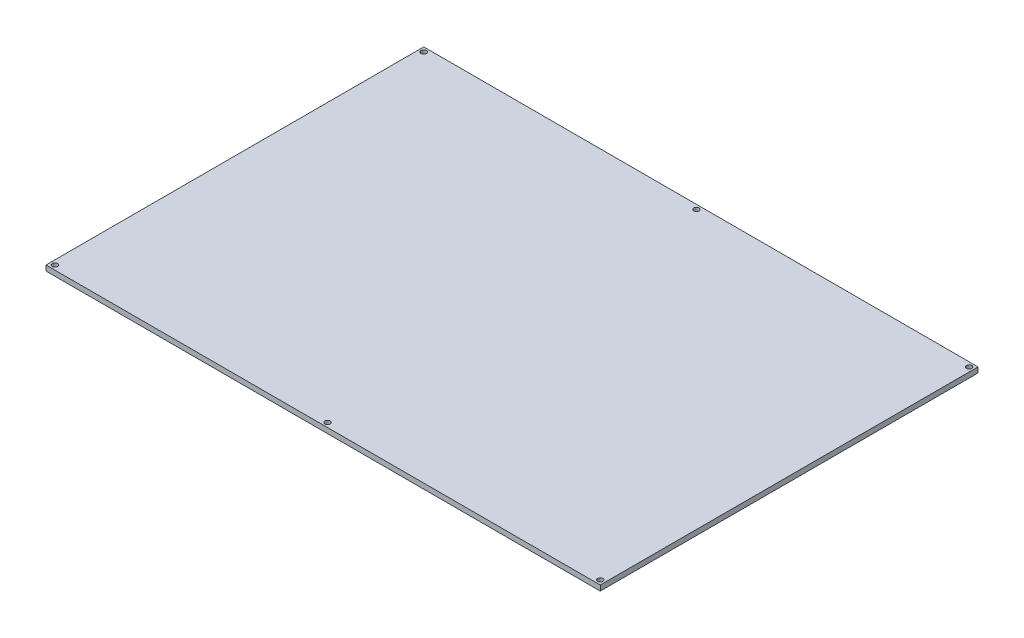
ISO-10303-21;
HEADER;
FILE_DESCRIPTION(('STEP AP214'),'2;1');
FILE_NAME('part.step','',(''),(''),'','','');
FILE_SCHEMA(('AUTOMOTIVE_DESIGN { 1 0 10303 214 1 1 1 1 }'));
ENDSEC;
DATA;
#1=APPLICATION_CONTEXT('core data for automotive mechanical design processes');
#2=APPLICATION_PROTOCOL_DEFINITION('international standard','automotive_design',2000,#1);
#3=PRODUCT_CONTEXT('',#1,'mechanical');
#4=PRODUCT('Part','Part','',(#3));
#5=PRODUCT_RELATED_PRODUCT_CATEGORY('part','',(#4));
#6=PRODUCT_DEFINITION_FORMATION('','',#4);
#7=PRODUCT_DEFINITION_CONTEXT('part definition',#1,'design');
#8=PRODUCT_DEFINITION('design','',#6,#7);
#9=PRODUCT_DEFINITION_SHAPE('','',#8);
#10=(LENGTH_UNIT() NAMED_UNIT(*) SI_UNIT(.MILLI.,.METRE.));
#11=(NAMED_UNIT(*) PLANE_ANGLE_UNIT() SI_UNIT($,.RADIAN.));
#12=(NAMED_UNIT(*) SI_UNIT($,.STERADIAN.) SOLID_ANGLE_UNIT());
#13=UNCERTAINTY_MEASURE_WITH_UNIT(LENGTH_MEASURE(1.E-05),#10,'distance_accuracy_value','');
#14=(GEOMETRIC_REPRESENTATION_CONTEXT(3) GLOBAL_UNCERTAINTY_ASSIGNED_CONTEXT((#13)) GLOBAL_UNIT_ASSIGNED_CONTEXT((#10,
#11,#12)) REPRESENTATION_CONTEXT('',''));
#15=CARTESIAN_POINT('',(0.,0.,0.));
#16=DIRECTION('',(0.,0.,1.));
#17=DIRECTION('',(1.,0.,0.));
#18=AXIS2_PLACEMENT_3D('',#15,#16,#17);
#19=CARTESIAN_POINT('',(0.,3.,0.));
#20=DIRECTION('',(0.,1.,0.));
#21=DIRECTION('',(0.,0.,1.));
#22=AXIS2_PLACEMENT_3D('',#19,#20,#21);
#23=PLANE('',#22);
#24=CARTESIAN_POINT('',(-157.,3.,-2.5));
#25=DIRECTION('',(0.,1.,0.));
#26=DIRECTION('',(0.,0.,1.));
#27=AXIS2_PLACEMENT_3D('',#24,#25,#26);
#28=CIRCLE('',#27,1.5);
#29=CARTESIAN_POINT('',(-157.,3.,-1.));
#30=VERTEX_POINT('',#29);
#31=EDGE_CURVE('E157',#30,#30,#28,.T.);
#32=ORIENTED_EDGE('',*,*,#31,.F.);
#33=EDGE_LOOP('',(#32));
#34=FACE_BOUND('',#33,.T.);
#35=CARTESIAN_POINT('',(-157.,3.,-211.5));
#36=DIRECTION('',(0.,1.,0.));
#37=DIRECTION('',(0.,0.,1.));
#38=AXIS2_PLACEMENT_3D('',#35,#36,#37);
#39=CIRCLE('',#38,1.5);
#40=CARTESIAN_POINT('',(-157.,3.,-210.));
#41=VERTEX_POINT('',#40);
#42=EDGE_CURVE('E164',#41,#41,#39,.T.);
#43=ORIENTED_EDGE('',*,*,#42,.F.);
#44=EDGE_LOOP('',(#43));
#45=FACE_BOUND('',#44,.T.);
#46=CARTESIAN_POINT('',(-2.5,3.,-2.5));
#47=DIRECTION('',(0.,1.,0.));
#48=DIRECTION('',(0.,0.,1.));
#49=AXIS2_PLACEMENT_3D('',#46,#47,#48);
#50=CIRCLE('',#49,1.5);
#51=CARTESIAN_POINT('',(-2.5,3.,-1.));
#52=VERTEX_POINT('',#51);
#53=EDGE_CURVE('E141',#52,#52,#50,.T.);
#54=ORIENTED_EDGE('',*,*,#53,.F.);
#55=EDGE_LOOP('',(#54));
#56=FACE_BOUND('',#55,.T.);
#57=CARTESIAN_POINT('',(-311.5,3.,-211.5));
#58=DIRECTION('',(0.,1.,0.));
#59=DIRECTION('',(0.,0.,1.));
#60=AXIS2_PLACEMENT_3D('',#57,#58,#59);
#61=CIRCLE('',#60,1.50000000000002);
#62=CARTESIAN_POINT('',(-311.5,3.,-210.));
#63=VERTEX_POINT('',#62);
#64=EDGE_CURVE('E111',#63,#63,#61,.T.);
#65=ORIENTED_EDGE('',*,*,#64,.F.);
#66=EDGE_LOOP('',(#65));
#67=FACE_BOUND('',#66,.T.);
#68=DIRECTION('',(0.,0.,1.));
#69=VECTOR('',#68,1.);
#70=CARTESIAN_POINT('',(-314.,3.,-214.));
#71=LINE('',#70,#69);
#72=CARTESIAN_POINT('',(-314.,3.,-214.));
#73=VERTEX_POINT('',#72);
#74=CARTESIAN_POINT('',(-314.,3.,0.));
#75=VERTEX_POINT('',#74);
#76=EDGE_CURVE('E91',#73,#75,#71,.T.);
#77=ORIENTED_EDGE('',*,*,#76,.T.);
#78=DIRECTION('',(1.,0.,0.));
#79=VECTOR('',#78,1.);
#80=CARTESIAN_POINT('',(-314.,3.,0.));
#81=LINE('',#80,#79);
#82=CARTESIAN_POINT('',(0.,3.,0.));
#83=VERTEX_POINT('',#82);
#84=EDGE_CURVE('E86',#75,#83,#81,.T.);
#85=ORIENTED_EDGE('',*,*,#84,.T.);
#86=DIRECTION('',(0.,0.,-1.));
#87=VECTOR('',#86,1.);
#88=CARTESIAN_POINT('',(0.,3.,-214.));
#89=LINE('',#88,#87);
#90=CARTESIAN_POINT('',(0.,3.,-214.));
#91=VERTEX_POINT('',#90);
#92=EDGE_CURVE('E89',#83,#91,#89,.T.);
#93=ORIENTED_EDGE('',*,*,#92,.T.);
#94=DIRECTION('',(-1.,0.,0.));
#95=VECTOR('',#94,1.);
#96=CARTESIAN_POINT('',(-314.,3.,-214.));
#97=LINE('',#96,#95);
#98=EDGE_CURVE('E56',#91,#73,#97,.T.);
#99=ORIENTED_EDGE('',*,*,#98,.T.);
#100=EDGE_LOOP('',(#77,#85,#93,#99));
#101=FACE_BOUND('',#100,.T.);
#102=CARTESIAN_POINT('',(-311.5,3.,-2.5));
#103=DIRECTION('',(0.,1.,0.));
#104=DIRECTION('',(0.,0.,1.));
#105=AXIS2_PLACEMENT_3D('',#102,#103,#104);
#106=CIRCLE('',#105,1.50000000000002);
#107=CARTESIAN_POINT('',(-311.5,3.,-0.999999999999976));
#108=VERTEX_POINT('',#107);
#109=EDGE_CURVE('E133',#108,#108,#106,.T.);
#110=ORIENTED_EDGE('',*,*,#109,.F.);
#111=EDGE_LOOP('',(#110));
#112=FACE_BOUND('',#111,.T.);
#113=CARTESIAN_POINT('',(-2.5,3.,-211.5));
#114=DIRECTION('',(0.,1.,0.));
#115=DIRECTION('',(0.,0.,1.));
#116=AXIS2_PLACEMENT_3D('',#113,#114,#115);
#117=CIRCLE('',#116,1.5);
#118=CARTESIAN_POINT('',(-2.5,3.,-210.));
#119=VERTEX_POINT('',#118);
#120=EDGE_CURVE('E149',#119,#119,#117,.T.);
#121=ORIENTED_EDGE('',*,*,#120,.F.);
#122=EDGE_LOOP('',(#121));
#123=FACE_BOUND('',#122,.T.);
#124=ADVANCED_FACE('F38',(#34,#45,#56,#67,#101,#112,#123),#23,.T.);
#125=CARTESIAN_POINT('',(0.,0.,0.));
#126=DIRECTION('',(0.,1.,0.));
#127=DIRECTION('',(0.,0.,1.));
#128=AXIS2_PLACEMENT_3D('',#125,#126,#127);
#129=PLANE('',#128);
#130=CARTESIAN_POINT('',(-157.,0.,-2.5));
#131=DIRECTION('',(0.,-1.,0.));
#132=DIRECTION('',(0.,0.,-1.));
#133=AXIS2_PLACEMENT_3D('',#130,#131,#132);
#134=CIRCLE('',#133,1.5);
#135=CARTESIAN_POINT('',(-157.,0.,-4.));
#136=VERTEX_POINT('',#135);
#137=EDGE_CURVE('E168',#136,#136,#134,.T.);
#138=ORIENTED_EDGE('',*,*,#137,.F.);
#139=EDGE_LOOP('',(#138));
#140=FACE_BOUND('',#139,.T.);
#141=CARTESIAN_POINT('',(-157.,0.,-211.5));
#142=DIRECTION('',(0.,-1.,0.));
#143=DIRECTION('',(0.,0.,-1.));
#144=AXIS2_PLACEMENT_3D('',#141,#142,#143);
#145=CIRCLE('',#144,1.5);
#146=CARTESIAN_POINT('',(-157.,0.,-213.));
#147=VERTEX_POINT('',#146);
#148=EDGE_CURVE('E169',#147,#147,#145,.T.);
#149=ORIENTED_EDGE('',*,*,#148,.F.);
#150=EDGE_LOOP('',(#149));
#151=FACE_BOUND('',#150,.T.);
#152=DIRECTION('',(0.,0.,1.));
#153=VECTOR('',#152,1.);
#154=CARTESIAN_POINT('',(-314.,0.,-214.));
#155=LINE('',#154,#153);
#156=CARTESIAN_POINT('',(-314.,0.,-214.));
#157=VERTEX_POINT('',#156);
#158=CARTESIAN_POINT('',(-314.,0.,0.));
#159=VERTEX_POINT('',#158);
#160=EDGE_CURVE('E107',#157,#159,#155,.T.);
#161=ORIENTED_EDGE('',*,*,#160,.F.);
#162=DIRECTION('',(-1.,0.,0.));
#163=VECTOR('',#162,1.);
#164=CARTESIAN_POINT('',(-314.,0.,-214.));
#165=LINE('',#164,#163);
#166=CARTESIAN_POINT('',(0.,0.,-214.));
#167=VERTEX_POINT('',#166);
#168=EDGE_CURVE('E79',#167,#157,#165,.T.);
#169=ORIENTED_EDGE('',*,*,#168,.F.);
#170=DIRECTION('',(0.,0.,-1.));
#171=VECTOR('',#170,1.);
#172=CARTESIAN_POINT('',(0.,0.,-214.));
#173=LINE('',#172,#171);
#174=CARTESIAN_POINT('',(0.,0.,0.));
#175=VERTEX_POINT('',#174);
#176=EDGE_CURVE('E73',#175,#167,#173,.T.);
#177=ORIENTED_EDGE('',*,*,#176,.F.);
#178=DIRECTION('',(1.,0.,0.));
#179=VECTOR('',#178,1.);
#180=CARTESIAN_POINT('',(-314.,0.,0.));
#181=LINE('',#180,#179);
#182=EDGE_CURVE('E96',#159,#175,#181,.T.);
#183=ORIENTED_EDGE('',*,*,#182,.F.);
#184=EDGE_LOOP('',(#161,#169,#177,#183));
#185=FACE_BOUND('',#184,.T.);
#186=CARTESIAN_POINT('',(-311.5,0.,-211.5));
#187=DIRECTION('',(0.,1.,0.));
#188=DIRECTION('',(0.,0.,1.));
#189=AXIS2_PLACEMENT_3D('',#186,#187,#188);
#190=CIRCLE('',#189,1.50000000000002);
#191=CARTESIAN_POINT('',(-311.5,0.,-210.));
#192=VERTEX_POINT('',#191);
#193=EDGE_CURVE('E129',#192,#192,#190,.T.);
#194=ORIENTED_EDGE('',*,*,#193,.T.);
#195=EDGE_LOOP('',(#194));
#196=FACE_BOUND('',#195,.T.);
#197=CARTESIAN_POINT('',(-311.5,0.,-2.5));
#198=DIRECTION('',(0.,1.,0.));
#199=DIRECTION('',(0.,0.,1.));
#200=AXIS2_PLACEMENT_3D('',#197,#198,#199);
#201=CIRCLE('',#200,1.50000000000002);
#202=CARTESIAN_POINT('',(-311.5,0.,-0.999999999999976));
#203=VERTEX_POINT('',#202);
#204=EDGE_CURVE('E137',#203,#203,#201,.T.);
#205=ORIENTED_EDGE('',*,*,#204,.T.);
#206=EDGE_LOOP('',(#205));
#207=FACE_BOUND('',#206,.T.);
#208=CARTESIAN_POINT('',(-2.5,0.,-2.5));
#209=DIRECTION('',(0.,1.,0.));
#210=DIRECTION('',(0.,0.,1.));
#211=AXIS2_PLACEMENT_3D('',#208,#209,#210);
#212=CIRCLE('',#211,1.5);
#213=CARTESIAN_POINT('',(-2.5,0.,-1.));
#214=VERTEX_POINT('',#213);
#215=EDGE_CURVE('E145',#214,#214,#212,.T.);
#216=ORIENTED_EDGE('',*,*,#215,.T.);
#217=EDGE_LOOP('',(#216));
#218=FACE_BOUND('',#217,.T.);
#219=CARTESIAN_POINT('',(-2.5,0.,-211.5));
#220=DIRECTION('',(0.,1.,0.));
#221=DIRECTION('',(0.,0.,1.));
#222=AXIS2_PLACEMENT_3D('',#219,#220,#221);
#223=CIRCLE('',#222,1.5);
#224=CARTESIAN_POINT('',(-2.5,0.,-210.));
#225=VERTEX_POINT('',#224);
#226=EDGE_CURVE('E153',#225,#225,#223,.T.);
#227=ORIENTED_EDGE('',*,*,#226,.T.);
#228=EDGE_LOOP('',(#227));
#229=FACE_BOUND('',#228,.T.);
#230=ADVANCED_FACE('F124',(#140,#151,#185,#196,#207,#218,#229),#129,.F.);
#231=CARTESIAN_POINT('',(-314.,3.,-214.));
#232=DIRECTION('',(1.,0.,0.));
#233=DIRECTION('',(0.,0.,-1.));
#234=AXIS2_PLACEMENT_3D('',#231,#232,#233);
#235=PLANE('',#234);
#236=ORIENTED_EDGE('',*,*,#160,.T.);
#237=DIRECTION('',(0.,-1.,0.));
#238=VECTOR('',#237,1.);
#239=CARTESIAN_POINT('',(-314.,3.,0.));
#240=LINE('',#239,#238);
#241=EDGE_CURVE('E11',#75,#159,#240,.T.);
#242=ORIENTED_EDGE('',*,*,#241,.F.);
#243=ORIENTED_EDGE('',*,*,#76,.F.);
#244=DIRECTION('',(0.,-1.,0.));
#245=VECTOR('',#244,1.);
#246=CARTESIAN_POINT('',(-314.,3.,-214.));
#247=LINE('',#246,#245);
#248=EDGE_CURVE('E103',#73,#157,#247,.T.);
#249=ORIENTED_EDGE('',*,*,#248,.T.);
#250=EDGE_LOOP('',(#236,#242,#243,#249));
#251=FACE_BOUND('',#250,.T.);
#252=ADVANCED_FACE('F40',(#251),#235,.F.);
#253=CARTESIAN_POINT('',(-314.,3.,0.));
#254=DIRECTION('',(0.,0.,-1.));
#255=DIRECTION('',(-1.,0.,0.));
#256=AXIS2_PLACEMENT_3D('',#253,#254,#255);
#257=PLANE('',#256);
#258=ORIENTED_EDGE('',*,*,#182,.T.);
#259=DIRECTION('',(0.,-1.,0.));
#260=VECTOR('',#259,1.);
#261=CARTESIAN_POINT('',(0.,3.,0.));
#262=LINE('',#261,#260);
#263=EDGE_CURVE('E48',#83,#175,#262,.T.);
#264=ORIENTED_EDGE('',*,*,#263,.F.);
#265=ORIENTED_EDGE('',*,*,#84,.F.);
#266=ORIENTED_EDGE('',*,*,#241,.T.);
#267=EDGE_LOOP('',(#258,#264,#265,#266));
#268=FACE_BOUND('',#267,.T.);
#269=ADVANCED_FACE('F95',(#268),#257,.F.);
#270=CARTESIAN_POINT('',(0.,3.,-214.));
#271=DIRECTION('',(-1.,0.,0.));
#272=DIRECTION('',(0.,0.,1.));
#273=AXIS2_PLACEMENT_3D('',#270,#271,#272);
#274=PLANE('',#273);
#275=ORIENTED_EDGE('',*,*,#176,.T.);
#276=DIRECTION('',(0.,-1.,0.));
#277=VECTOR('',#276,1.);
#278=CARTESIAN_POINT('',(0.,3.,-214.));
#279=LINE('',#278,#277);
#280=EDGE_CURVE('E98',#91,#167,#279,.T.);
#281=ORIENTED_EDGE('',*,*,#280,.F.);
#282=ORIENTED_EDGE('',*,*,#92,.F.);
#283=ORIENTED_EDGE('',*,*,#263,.T.);
#284=EDGE_LOOP('',(#275,#281,#282,#283));
#285=FACE_BOUND('',#284,.T.);
#286=ADVANCED_FACE('F99',(#285),#274,.F.);
#287=CARTESIAN_POINT('',(-314.,3.,-214.));
#288=DIRECTION('',(0.,0.,1.));
#289=DIRECTION('',(1.,0.,0.));
#290=AXIS2_PLACEMENT_3D('',#287,#288,#289);
#291=PLANE('',#290);
#292=ORIENTED_EDGE('',*,*,#168,.T.);
#293=ORIENTED_EDGE('',*,*,#248,.F.);
#294=ORIENTED_EDGE('',*,*,#98,.F.);
#295=ORIENTED_EDGE('',*,*,#280,.T.);
#296=EDGE_LOOP('',(#292,#293,#294,#295));
#297=FACE_BOUND('',#296,.T.);
#298=ADVANCED_FACE('F121',(#297),#291,.F.);
#299=CARTESIAN_POINT('',(-311.5,3.,-211.5));
#300=DIRECTION('',(0.,-1.,0.));
#301=DIRECTION('',(0.,0.,-1.));
#302=AXIS2_PLACEMENT_3D('',#299,#300,#301);
#303=CYLINDRICAL_SURFACE('',#302,1.50000000000002);
#304=ORIENTED_EDGE('',*,*,#64,.T.);
#305=EDGE_LOOP('',(#304));
#306=FACE_BOUND('',#305,.T.);
#307=ORIENTED_EDGE('',*,*,#193,.F.);
#308=EDGE_LOOP('',(#307));
#309=FACE_BOUND('',#308,.T.);
#310=ADVANCED_FACE('F207',(#306,#309),#303,.F.);
#311=CARTESIAN_POINT('',(-311.5,3.,-2.5));
#312=DIRECTION('',(0.,-1.,0.));
#313=DIRECTION('',(0.,0.,-1.));
#314=AXIS2_PLACEMENT_3D('',#311,#312,#313);
#315=CYLINDRICAL_SURFACE('',#314,1.50000000000002);
#316=ORIENTED_EDGE('',*,*,#109,.T.);
#317=EDGE_LOOP('',(#316));
#318=FACE_BOUND('',#317,.T.);
#319=ORIENTED_EDGE('',*,*,#204,.F.);
#320=EDGE_LOOP('',(#319));
#321=FACE_BOUND('',#320,.T.);
#322=ADVANCED_FACE('F251',(#318,#321),#315,.F.);
#323=CARTESIAN_POINT('',(-2.5,3.,-2.5));
#324=DIRECTION('',(0.,-1.,0.));
#325=DIRECTION('',(0.,0.,-1.));
#326=AXIS2_PLACEMENT_3D('',#323,#324,#325);
#327=CYLINDRICAL_SURFACE('',#326,1.5);
#328=ORIENTED_EDGE('',*,*,#53,.T.);
#329=EDGE_LOOP('',(#328));
#330=FACE_BOUND('',#329,.T.);
#331=ORIENTED_EDGE('',*,*,#215,.F.);
#332=EDGE_LOOP('',(#331));
#333=FACE_BOUND('',#332,.T.);
#334=ADVANCED_FACE('F195',(#330,#333),#327,.F.);
#335=CARTESIAN_POINT('',(-2.5,3.,-211.5));
#336=DIRECTION('',(0.,-1.,0.));
#337=DIRECTION('',(0.,0.,-1.));
#338=AXIS2_PLACEMENT_3D('',#335,#336,#337);
#339=CYLINDRICAL_SURFACE('',#338,1.5);
#340=ORIENTED_EDGE('',*,*,#120,.T.);
#341=EDGE_LOOP('',(#340));
#342=FACE_BOUND('',#341,.T.);
#343=ORIENTED_EDGE('',*,*,#226,.F.);
#344=EDGE_LOOP('',(#343));
#345=FACE_BOUND('',#344,.T.);
#346=ADVANCED_FACE('F186',(#342,#345),#339,.F.);
#347=CARTESIAN_POINT('',(-157.,10.,-211.5));
#348=DIRECTION('',(0.,-1.,0.));
#349=DIRECTION('',(0.,0.,-1.));
#350=AXIS2_PLACEMENT_3D('',#347,#348,#349);
#351=CYLINDRICAL_SURFACE('',#350,1.5);
#352=ORIENTED_EDGE('',*,*,#42,.T.);
#353=EDGE_LOOP('',(#352));
#354=FACE_BOUND('',#353,.T.);
#355=ORIENTED_EDGE('',*,*,#148,.T.);
#356=EDGE_LOOP('',(#355));
#357=FACE_BOUND('',#356,.T.);
#358=ADVANCED_FACE('F184',(#354,#357),#351,.F.);
#359=CARTESIAN_POINT('',(-157.,10.,-2.5));
#360=DIRECTION('',(0.,-1.,0.));
#361=DIRECTION('',(0.,0.,-1.));
#362=AXIS2_PLACEMENT_3D('',#359,#360,#361);
#363=CYLINDRICAL_SURFACE('',#362,1.5);
#364=ORIENTED_EDGE('',*,*,#31,.T.);
#365=EDGE_LOOP('',(#364));
#366=FACE_BOUND('',#365,.T.);
#367=ORIENTED_EDGE('',*,*,#137,.T.);
#368=EDGE_LOOP('',(#367));
#369=FACE_BOUND('',#368,.T.);
#370=ADVANCED_FACE('F177',(#366,#369),#363,.F.);
#371=CLOSED_SHELL('',(#124,#230,#252,#269,#286,#298,#310,#322,#334,#346,#358,#370));
#372=MANIFOLD_SOLID_BREP('B2',#371);
#373=ADVANCED_BREP_SHAPE_REPRESENTATION('',(#18,#372),#14);
#374=SHAPE_DEFINITION_REPRESENTATION(#9,#373);
ENDSEC;
END-ISO-10303-21;
